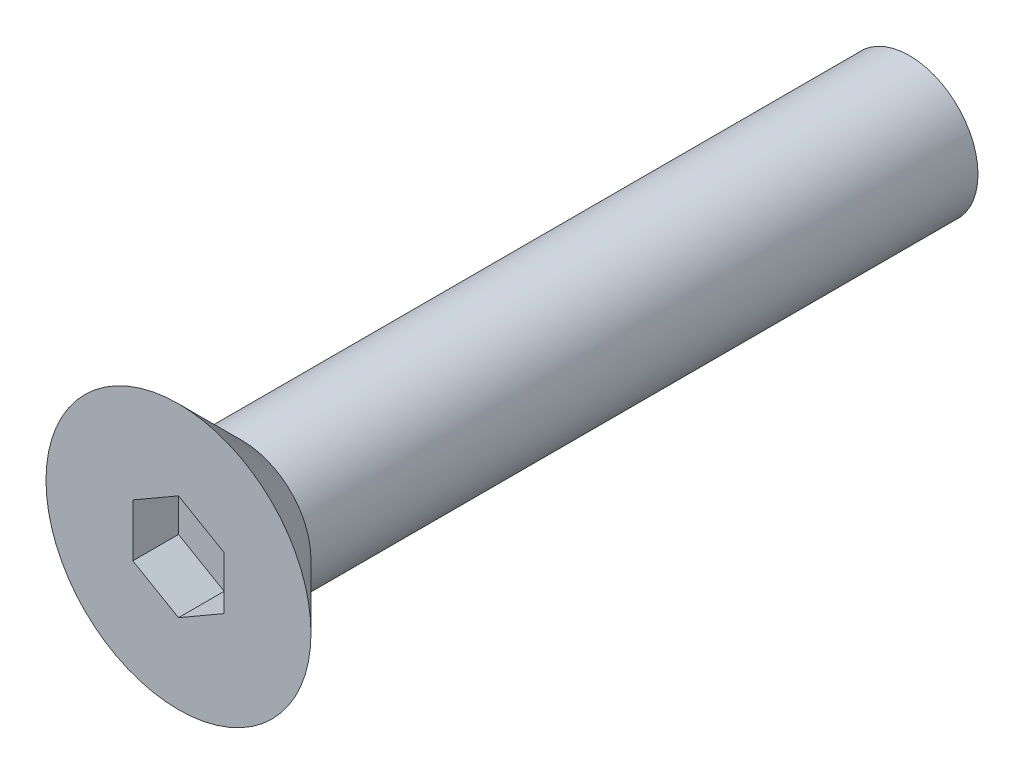
ISO-10303-21;
HEADER;
FILE_DESCRIPTION(('STEP AP214'),'2;1');
FILE_NAME('part.step','',(''),(''),'','','');
FILE_SCHEMA(('AUTOMOTIVE_DESIGN { 1 0 10303 214 1 1 1 1 }'));
ENDSEC;
DATA;
#1=APPLICATION_CONTEXT('core data for automotive mechanical design processes');
#2=APPLICATION_PROTOCOL_DEFINITION('international standard','automotive_design',2000,#1);
#3=PRODUCT_CONTEXT('',#1,'mechanical');
#4=PRODUCT('Part','Part','',(#3));
#5=PRODUCT_RELATED_PRODUCT_CATEGORY('part','',(#4));
#6=PRODUCT_DEFINITION_FORMATION('','',#4);
#7=PRODUCT_DEFINITION_CONTEXT('part definition',#1,'design');
#8=PRODUCT_DEFINITION('design','',#6,#7);
#9=PRODUCT_DEFINITION_SHAPE('','',#8);
#10=(LENGTH_UNIT() NAMED_UNIT(*) SI_UNIT(.MILLI.,.METRE.));
#11=(NAMED_UNIT(*) PLANE_ANGLE_UNIT() SI_UNIT($,.RADIAN.));
#12=(NAMED_UNIT(*) SI_UNIT($,.STERADIAN.) SOLID_ANGLE_UNIT());
#13=UNCERTAINTY_MEASURE_WITH_UNIT(LENGTH_MEASURE(1.E-05),#10,'distance_accuracy_value','');
#14=(GEOMETRIC_REPRESENTATION_CONTEXT(3) GLOBAL_UNCERTAINTY_ASSIGNED_CONTEXT((#13)) GLOBAL_UNIT_ASSIGNED_CONTEXT((#10,
#11,#12)) REPRESENTATION_CONTEXT('',''));
#15=CARTESIAN_POINT('',(0.,0.,0.));
#16=DIRECTION('',(0.,0.,1.));
#17=DIRECTION('',(1.,0.,0.));
#18=AXIS2_PLACEMENT_3D('',#15,#16,#17);
#19=CARTESIAN_POINT('',(0.,0.,0.));
#20=DIRECTION('',(0.,0.,-1.));
#21=DIRECTION('',(0.,-1.,0.));
#22=AXIS2_PLACEMENT_3D('',#19,#20,#21);
#23=PLANE('',#22);
#24=CARTESIAN_POINT('',(0.,0.,0.));
#25=DIRECTION('',(0.,0.,-1.));
#26=DIRECTION('',(1.,0.,0.));
#27=AXIS2_PLACEMENT_3D('',#24,#25,#26);
#28=CIRCLE('',#27,1.5);
#29=CARTESIAN_POINT('',(-1.5,0.,0.));
#30=VERTEX_POINT('',#29);
#31=CARTESIAN_POINT('',(1.5,0.,0.));
#32=VERTEX_POINT('',#31);
#33=EDGE_CURVE('E182',#30,#32,#28,.T.);
#34=ORIENTED_EDGE('',*,*,#33,.T.);
#35=CARTESIAN_POINT('',(0.,0.,0.));
#36=DIRECTION('',(0.,0.,-1.));
#37=DIRECTION('',(1.,0.,0.));
#38=AXIS2_PLACEMENT_3D('',#35,#36,#37);
#39=CIRCLE('',#38,1.5);
#40=EDGE_CURVE('E27',#32,#30,#39,.T.);
#41=ORIENTED_EDGE('',*,*,#40,.T.);
#42=EDGE_LOOP('',(#34,#41));
#43=FACE_BOUND('',#42,.T.);
#44=ADVANCED_FACE('F16',(#43),#23,.T.);
#45=CARTESIAN_POINT('',(0.,0.,7.3));
#46=DIRECTION('',(0.,0.,-1.));
#47=DIRECTION('',(-1.,0.,0.));
#48=AXIS2_PLACEMENT_3D('',#45,#46,#47);
#49=CYLINDRICAL_SURFACE('',#48,1.5);
#50=ORIENTED_EDGE('',*,*,#33,.F.);
#51=ORIENTED_EDGE('',*,*,#40,.F.);
#52=DIRECTION('',(0.,0.,1.));
#53=VECTOR('',#52,1.);
#54=CARTESIAN_POINT('',(1.5,0.,7.3));
#55=LINE('',#54,#53);
#56=CARTESIAN_POINT('',(1.5,0.,14.6));
#57=VERTEX_POINT('',#56);
#58=EDGE_CURVE('E11',#32,#57,#55,.T.);
#59=ORIENTED_EDGE('',*,*,#58,.T.);
#60=CARTESIAN_POINT('',(0.,0.,14.6));
#61=DIRECTION('',(0.,0.,-1.));
#62=DIRECTION('',(1.,0.,0.));
#63=AXIS2_PLACEMENT_3D('',#60,#61,#62);
#64=CIRCLE('',#63,1.5);
#65=CARTESIAN_POINT('',(-1.5,0.,14.6));
#66=VERTEX_POINT('',#65);
#67=EDGE_CURVE('E20',#57,#66,#64,.T.);
#68=ORIENTED_EDGE('',*,*,#67,.T.);
#69=CARTESIAN_POINT('',(0.,0.,14.6));
#70=DIRECTION('',(0.,0.,-1.));
#71=DIRECTION('',(1.,0.,0.));
#72=AXIS2_PLACEMENT_3D('',#69,#70,#71);
#73=CIRCLE('',#72,1.5);
#74=EDGE_CURVE('E143',#66,#57,#73,.T.);
#75=ORIENTED_EDGE('',*,*,#74,.T.);
#76=ORIENTED_EDGE('',*,*,#58,.F.);
#77=EDGE_LOOP('',(#50,#51,#59,#68,#75,#76));
#78=FACE_BOUND('',#77,.T.);
#79=ADVANCED_FACE('F254',(#78),#49,.T.);
#80=CARTESIAN_POINT('',(0.,0.,15.3));
#81=DIRECTION('',(0.,0.,1.));
#82=DIRECTION('',(-1.,0.,0.));
#83=AXIS2_PLACEMENT_3D('',#80,#81,#82);
#84=CONICAL_SURFACE('',#83,2.2,0.785398163397383);
#85=ORIENTED_EDGE('',*,*,#74,.F.);
#86=ORIENTED_EDGE('',*,*,#67,.F.);
#87=DIRECTION('',(0.707106781186502,0.,0.707106781186593));
#88=VECTOR('',#87,1.);
#89=CARTESIAN_POINT('',(2.2,0.,15.3));
#90=LINE('',#89,#88);
#91=CARTESIAN_POINT('',(2.90000000000004,0.,16.0000000000003));
#92=VERTEX_POINT('',#91);
#93=EDGE_CURVE('E186',#57,#92,#90,.T.);
#94=ORIENTED_EDGE('',*,*,#93,.T.);
#95=CARTESIAN_POINT('',(0.,0.,16.0000000000003));
#96=DIRECTION('',(0.,0.,-1.));
#97=DIRECTION('',(1.,0.,0.));
#98=AXIS2_PLACEMENT_3D('',#95,#96,#97);
#99=CIRCLE('',#98,2.90000000000004);
#100=CARTESIAN_POINT('',(-2.90000000000004,0.,16.0000000000003));
#101=VERTEX_POINT('',#100);
#102=EDGE_CURVE('E146',#92,#101,#99,.T.);
#103=ORIENTED_EDGE('',*,*,#102,.T.);
#104=CARTESIAN_POINT('',(0.,0.,16.0000000000003));
#105=DIRECTION('',(0.,0.,-1.));
#106=DIRECTION('',(1.,0.,0.));
#107=AXIS2_PLACEMENT_3D('',#104,#105,#106);
#108=CIRCLE('',#107,2.90000000000004);
#109=EDGE_CURVE('E147',#101,#92,#108,.T.);
#110=ORIENTED_EDGE('',*,*,#109,.T.);
#111=ORIENTED_EDGE('',*,*,#93,.F.);
#112=EDGE_LOOP('',(#85,#86,#94,#103,#110,#111));
#113=FACE_BOUND('',#112,.T.);
#114=ADVANCED_FACE('F248',(#113),#84,.T.);
#115=CARTESIAN_POINT('',(-2.90000000000004,0.,16.0000000000003));
#116=DIRECTION('',(0.,0.,1.));
#117=DIRECTION('',(1.,0.,0.));
#118=AXIS2_PLACEMENT_3D('',#115,#116,#117);
#119=PLANE('',#118);
#120=DIRECTION('',(0.866025403784439,-0.5,0.));
#121=VECTOR('',#120,1.);
#122=CARTESIAN_POINT('',(-0.837500000000016,1.63823138882557,16.0000000000003));
#123=LINE('',#122,#121);
#124=CARTESIAN_POINT('',(0.,1.15470053837925,16.0000000000003));
#125=VERTEX_POINT('',#124);
#126=CARTESIAN_POINT('',(1.,0.577350269189626,16.0000000000003));
#127=VERTEX_POINT('',#126);
#128=EDGE_CURVE('E114',#125,#127,#123,.T.);
#129=ORIENTED_EDGE('',*,*,#128,.T.);
#130=DIRECTION('',(0.,-1.,0.));
#131=VECTOR('',#130,1.);
#132=CARTESIAN_POINT('',(1.,0.288675134594812,16.0000000000003));
#133=LINE('',#132,#131);
#134=CARTESIAN_POINT('',(1.,-0.577350269189627,16.0000000000003));
#135=VERTEX_POINT('',#134);
#136=EDGE_CURVE('E106',#127,#135,#133,.T.);
#137=ORIENTED_EDGE('',*,*,#136,.T.);
#138=DIRECTION('',(-0.866025403784439,-0.5,0.));
#139=VECTOR('',#138,1.);
#140=CARTESIAN_POINT('',(-0.33750000000002,-1.34955625423076,16.0000000000003));
#141=LINE('',#140,#139);
#142=CARTESIAN_POINT('',(0.,-1.15470053837925,16.0000000000003));
#143=VERTEX_POINT('',#142);
#144=EDGE_CURVE('E111',#135,#143,#141,.T.);
#145=ORIENTED_EDGE('',*,*,#144,.T.);
#146=DIRECTION('',(-0.866025403784438,0.5,0.));
#147=VECTOR('',#146,1.);
#148=CARTESIAN_POINT('',(-1.33750000000002,-0.382494553338116,16.0000000000003));
#149=LINE('',#148,#147);
#150=CARTESIAN_POINT('',(-1.,-0.577350269189625,16.0000000000003));
#151=VERTEX_POINT('',#150);
#152=EDGE_CURVE('E156',#143,#151,#149,.T.);
#153=ORIENTED_EDGE('',*,*,#152,.T.);
#154=DIRECTION('',(0.,1.,0.));
#155=VECTOR('',#154,1.);
#156=CARTESIAN_POINT('',(-1.,-0.288675134594813,16.0000000000003));
#157=LINE('',#156,#155);
#158=CARTESIAN_POINT('',(-1.,0.577350269189626,16.0000000000003));
#159=VERTEX_POINT('',#158);
#160=EDGE_CURVE('E151',#151,#159,#157,.T.);
#161=ORIENTED_EDGE('',*,*,#160,.T.);
#162=DIRECTION('',(0.866025403784439,0.5,0.));
#163=VECTOR('',#162,1.);
#164=CARTESIAN_POINT('',(-1.8375,0.093819418743305,16.0000000000003));
#165=LINE('',#164,#163);
#166=EDGE_CURVE('E160',#159,#125,#165,.T.);
#167=ORIENTED_EDGE('',*,*,#166,.T.);
#168=EDGE_LOOP('',(#129,#137,#145,#153,#161,#167));
#169=FACE_BOUND('',#168,.T.);
#170=ORIENTED_EDGE('',*,*,#109,.F.);
#171=ORIENTED_EDGE('',*,*,#102,.F.);
#172=EDGE_LOOP('',(#170,#171));
#173=FACE_BOUND('',#172,.T.);
#174=ADVANCED_FACE('F108',(#169,#173),#119,.T.);
#175=CARTESIAN_POINT('',(0.,0.,15.0000000000003));
#176=DIRECTION('',(0.,0.,-1.));
#177=DIRECTION('',(0.,-1.,0.));
#178=AXIS2_PLACEMENT_3D('',#175,#176,#177);
#179=PLANE('',#178);
#180=DIRECTION('',(0.,-1.,0.));
#181=VECTOR('',#180,1.);
#182=CARTESIAN_POINT('',(1.,-0.577350269189627,15.0000000000003));
#183=LINE('',#182,#181);
#184=CARTESIAN_POINT('',(1.,0.577350269189626,15.0000000000003));
#185=VERTEX_POINT('',#184);
#186=CARTESIAN_POINT('',(1.,-0.577350269189627,15.0000000000003));
#187=VERTEX_POINT('',#186);
#188=EDGE_CURVE('E119',#185,#187,#183,.T.);
#189=ORIENTED_EDGE('',*,*,#188,.F.);
#190=DIRECTION('',(0.866025403784439,-0.5,0.));
#191=VECTOR('',#190,1.);
#192=CARTESIAN_POINT('',(1.,0.577350269189626,15.0000000000003));
#193=LINE('',#192,#191);
#194=CARTESIAN_POINT('',(0.,1.15470053837925,15.0000000000003));
#195=VERTEX_POINT('',#194);
#196=EDGE_CURVE('E172',#195,#185,#193,.T.);
#197=ORIENTED_EDGE('',*,*,#196,.F.);
#198=DIRECTION('',(0.866025403784439,0.5,0.));
#199=VECTOR('',#198,1.);
#200=CARTESIAN_POINT('',(0.,1.15470053837925,15.0000000000003));
#201=LINE('',#200,#199);
#202=CARTESIAN_POINT('',(-1.,0.577350269189626,15.0000000000003));
#203=VERTEX_POINT('',#202);
#204=EDGE_CURVE('E155',#203,#195,#201,.T.);
#205=ORIENTED_EDGE('',*,*,#204,.F.);
#206=DIRECTION('',(0.,1.,0.));
#207=VECTOR('',#206,1.);
#208=CARTESIAN_POINT('',(-1.,0.577350269189626,15.0000000000003));
#209=LINE('',#208,#207);
#210=CARTESIAN_POINT('',(-1.,-0.577350269189625,15.0000000000003));
#211=VERTEX_POINT('',#210);
#212=EDGE_CURVE('E159',#211,#203,#209,.T.);
#213=ORIENTED_EDGE('',*,*,#212,.F.);
#214=DIRECTION('',(-0.866025403784438,0.5,0.));
#215=VECTOR('',#214,1.);
#216=CARTESIAN_POINT('',(-1.,-0.577350269189625,15.0000000000003));
#217=LINE('',#216,#215);
#218=CARTESIAN_POINT('',(0.,-1.15470053837925,15.0000000000003));
#219=VERTEX_POINT('',#218);
#220=EDGE_CURVE('E133',#219,#211,#217,.T.);
#221=ORIENTED_EDGE('',*,*,#220,.F.);
#222=DIRECTION('',(-0.866025403784439,-0.5,0.));
#223=VECTOR('',#222,1.);
#224=CARTESIAN_POINT('',(0.,-1.15470053837925,15.0000000000003));
#225=LINE('',#224,#223);
#226=EDGE_CURVE('E120',#187,#219,#225,.T.);
#227=ORIENTED_EDGE('',*,*,#226,.F.);
#228=EDGE_LOOP('',(#189,#197,#205,#213,#221,#227));
#229=FACE_BOUND('',#228,.T.);
#230=ADVANCED_FACE('F247',(#229),#179,.F.);
#231=CARTESIAN_POINT('',(1.,0.577350269189626,16.0000000000003));
#232=DIRECTION('',(1.,0.,0.));
#233=DIRECTION('',(0.,-1.,0.));
#234=AXIS2_PLACEMENT_3D('',#231,#232,#233);
#235=PLANE('',#234);
#236=ORIENTED_EDGE('',*,*,#136,.F.);
#237=DIRECTION('',(0.,0.,-1.));
#238=VECTOR('',#237,1.);
#239=CARTESIAN_POINT('',(1.,0.577350269189626,16.0000000000003));
#240=LINE('',#239,#238);
#241=EDGE_CURVE('E163',#127,#185,#240,.T.);
#242=ORIENTED_EDGE('',*,*,#241,.T.);
#243=ORIENTED_EDGE('',*,*,#188,.T.);
#244=DIRECTION('',(0.,0.,-1.));
#245=VECTOR('',#244,1.);
#246=CARTESIAN_POINT('',(1.,-0.577350269189627,16.0000000000003));
#247=LINE('',#246,#245);
#248=EDGE_CURVE('E123',#135,#187,#247,.T.);
#249=ORIENTED_EDGE('',*,*,#248,.F.);
#250=EDGE_LOOP('',(#236,#242,#243,#249));
#251=FACE_BOUND('',#250,.T.);
#252=ADVANCED_FACE('F124',(#251),#235,.F.);
#253=CARTESIAN_POINT('',(1.,-0.577350269189627,16.0000000000003));
#254=DIRECTION('',(0.5,-0.866025403784439,0.));
#255=DIRECTION('',(0.,0.,-1.));
#256=AXIS2_PLACEMENT_3D('',#253,#254,#255);
#257=PLANE('',#256);
#258=ORIENTED_EDGE('',*,*,#144,.F.);
#259=ORIENTED_EDGE('',*,*,#248,.T.);
#260=ORIENTED_EDGE('',*,*,#226,.T.);
#261=DIRECTION('',(0.,0.,-1.));
#262=VECTOR('',#261,1.);
#263=CARTESIAN_POINT('',(0.,-1.15470053837925,16.0000000000003));
#264=LINE('',#263,#262);
#265=EDGE_CURVE('E130',#143,#219,#264,.T.);
#266=ORIENTED_EDGE('',*,*,#265,.F.);
#267=EDGE_LOOP('',(#258,#259,#260,#266));
#268=FACE_BOUND('',#267,.T.);
#269=ADVANCED_FACE('F128',(#268),#257,.F.);
#270=CARTESIAN_POINT('',(0.,-1.15470053837925,16.0000000000003));
#271=DIRECTION('',(-0.5,-0.866025403784438,0.));
#272=DIRECTION('',(-0.866025403784438,0.5,0.));
#273=AXIS2_PLACEMENT_3D('',#270,#271,#272);
#274=PLANE('',#273);
#275=ORIENTED_EDGE('',*,*,#152,.F.);
#276=ORIENTED_EDGE('',*,*,#265,.T.);
#277=ORIENTED_EDGE('',*,*,#220,.T.);
#278=DIRECTION('',(0.,0.,-1.));
#279=VECTOR('',#278,1.);
#280=CARTESIAN_POINT('',(-1.,-0.577350269189625,16.0000000000003));
#281=LINE('',#280,#279);
#282=EDGE_CURVE('E154',#151,#211,#281,.T.);
#283=ORIENTED_EDGE('',*,*,#282,.F.);
#284=EDGE_LOOP('',(#275,#276,#277,#283));
#285=FACE_BOUND('',#284,.T.);
#286=ADVANCED_FACE('F292',(#285),#274,.F.);
#287=CARTESIAN_POINT('',(-1.,-0.577350269189625,16.0000000000003));
#288=DIRECTION('',(-1.,0.,0.));
#289=DIRECTION('',(0.,0.,1.));
#290=AXIS2_PLACEMENT_3D('',#287,#288,#289);
#291=PLANE('',#290);
#292=ORIENTED_EDGE('',*,*,#160,.F.);
#293=ORIENTED_EDGE('',*,*,#282,.T.);
#294=ORIENTED_EDGE('',*,*,#212,.T.);
#295=DIRECTION('',(0.,0.,-1.));
#296=VECTOR('',#295,1.);
#297=CARTESIAN_POINT('',(-1.,0.577350269189626,16.0000000000003));
#298=LINE('',#297,#296);
#299=EDGE_CURVE('E162',#159,#203,#298,.T.);
#300=ORIENTED_EDGE('',*,*,#299,.F.);
#301=EDGE_LOOP('',(#292,#293,#294,#300));
#302=FACE_BOUND('',#301,.T.);
#303=ADVANCED_FACE('F287',(#302),#291,.F.);
#304=CARTESIAN_POINT('',(-1.,0.577350269189626,16.0000000000003));
#305=DIRECTION('',(-0.5,0.866025403784439,0.));
#306=DIRECTION('',(0.,0.,1.));
#307=AXIS2_PLACEMENT_3D('',#304,#305,#306);
#308=PLANE('',#307);
#309=ORIENTED_EDGE('',*,*,#166,.F.);
#310=ORIENTED_EDGE('',*,*,#299,.T.);
#311=ORIENTED_EDGE('',*,*,#204,.T.);
#312=DIRECTION('',(0.,0.,-1.));
#313=VECTOR('',#312,1.);
#314=CARTESIAN_POINT('',(0.,1.15470053837925,16.0000000000003));
#315=LINE('',#314,#313);
#316=EDGE_CURVE('E178',#125,#195,#315,.T.);
#317=ORIENTED_EDGE('',*,*,#316,.F.);
#318=EDGE_LOOP('',(#309,#310,#311,#317));
#319=FACE_BOUND('',#318,.T.);
#320=ADVANCED_FACE('F18',(#319),#308,.F.);
#321=CARTESIAN_POINT('',(0.,1.15470053837925,16.0000000000003));
#322=DIRECTION('',(0.5,0.866025403784439,0.));
#323=DIRECTION('',(0.,0.,-1.));
#324=AXIS2_PLACEMENT_3D('',#321,#322,#323);
#325=PLANE('',#324);
#326=ORIENTED_EDGE('',*,*,#128,.F.);
#327=ORIENTED_EDGE('',*,*,#316,.T.);
#328=ORIENTED_EDGE('',*,*,#196,.T.);
#329=ORIENTED_EDGE('',*,*,#241,.F.);
#330=EDGE_LOOP('',(#326,#327,#328,#329));
#331=FACE_BOUND('',#330,.T.);
#332=ADVANCED_FACE('F270',(#331),#325,.F.);
#333=CLOSED_SHELL('',(#44,#79,#114,#174,#230,#252,#269,#286,#303,#320,#332));
#334=MANIFOLD_SOLID_BREP('B1',#333);
#335=ADVANCED_BREP_SHAPE_REPRESENTATION('',(#18,#334),#14);
#336=SHAPE_DEFINITION_REPRESENTATION(#9,#335);
ENDSEC;
END-ISO-10303-21;
